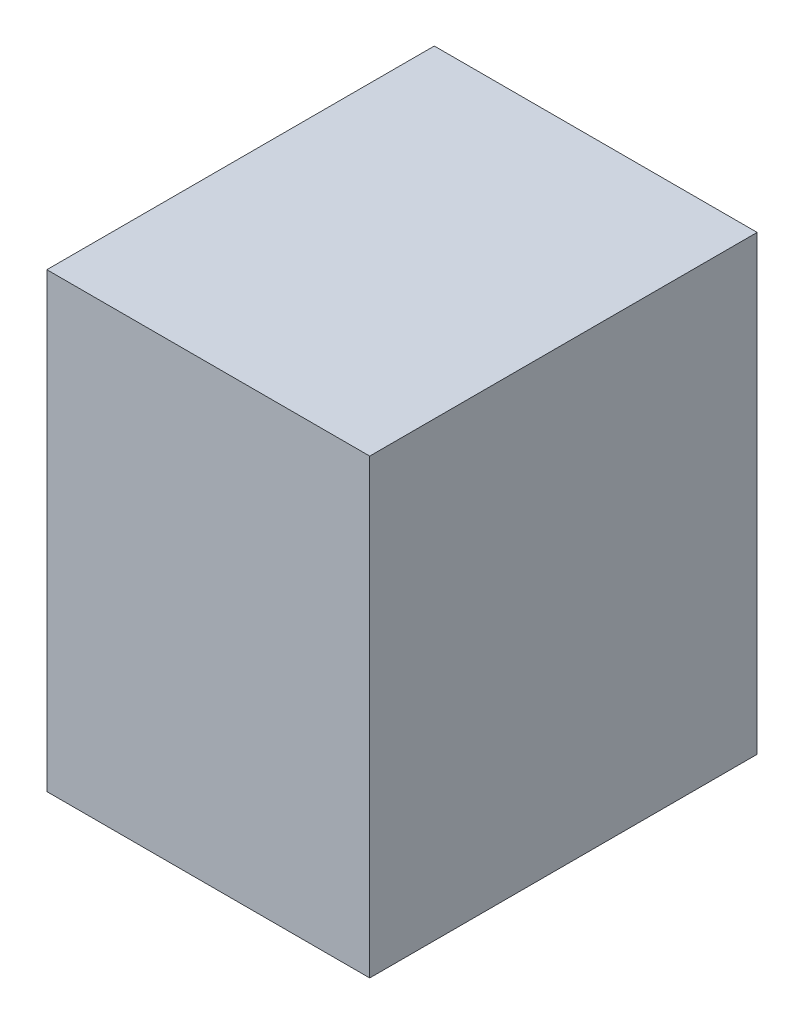
ISO-10303-21;
HEADER;
FILE_DESCRIPTION(('STEP AP214'),'2;1');
FILE_NAME('part.step','',(''),(''),'','','');
FILE_SCHEMA(('AUTOMOTIVE_DESIGN { 1 0 10303 214 1 1 1 1 }'));
ENDSEC;
DATA;
#1=APPLICATION_CONTEXT('core data for automotive mechanical design processes');
#2=APPLICATION_PROTOCOL_DEFINITION('international standard','automotive_design',2000,#1);
#3=PRODUCT_CONTEXT('',#1,'mechanical');
#4=PRODUCT('Part','Part','',(#3));
#5=PRODUCT_RELATED_PRODUCT_CATEGORY('part','',(#4));
#6=PRODUCT_DEFINITION_FORMATION('','',#4);
#7=PRODUCT_DEFINITION_CONTEXT('part definition',#1,'design');
#8=PRODUCT_DEFINITION('design','',#6,#7);
#9=PRODUCT_DEFINITION_SHAPE('','',#8);
#10=(LENGTH_UNIT() NAMED_UNIT(*) SI_UNIT(.MILLI.,.METRE.));
#11=(NAMED_UNIT(*) PLANE_ANGLE_UNIT() SI_UNIT($,.RADIAN.));
#12=(NAMED_UNIT(*) SI_UNIT($,.STERADIAN.) SOLID_ANGLE_UNIT());
#13=UNCERTAINTY_MEASURE_WITH_UNIT(LENGTH_MEASURE(1.E-05),#10,'distance_accuracy_value','');
#14=(GEOMETRIC_REPRESENTATION_CONTEXT(3) GLOBAL_UNCERTAINTY_ASSIGNED_CONTEXT((#13)) GLOBAL_UNIT_ASSIGNED_CONTEXT((#10,
#11,#12)) REPRESENTATION_CONTEXT('',''));
#15=CARTESIAN_POINT('',(0.,0.,0.));
#16=DIRECTION('',(0.,0.,1.));
#17=DIRECTION('',(1.,0.,0.));
#18=AXIS2_PLACEMENT_3D('',#15,#16,#17);
#19=CARTESIAN_POINT('',(-65.3514271572348,35.9943181818182,60.));
#20=DIRECTION('',(1.,0.,0.));
#21=DIRECTION('',(0.,0.,-1.));
#22=AXIS2_PLACEMENT_3D('',#19,#20,#21);
#23=PLANE('',#22);
#24=DIRECTION('',(0.,-1.,0.));
#25=VECTOR('',#24,1.);
#26=CARTESIAN_POINT('',(-65.3514271572348,35.9943181818182,0.));
#27=LINE('',#26,#25);
#28=CARTESIAN_POINT('',(-65.3514271572348,35.9943181818182,0.));
#29=VERTEX_POINT('',#28);
#30=CARTESIAN_POINT('',(-65.3514271572348,-34.0056818181818,0.));
#31=VERTEX_POINT('',#30);
#32=EDGE_CURVE('E96',#29,#31,#27,.T.);
#33=ORIENTED_EDGE('',*,*,#32,.T.);
#34=DIRECTION('',(0.,0.,-1.));
#35=VECTOR('',#34,1.);
#36=CARTESIAN_POINT('',(-65.3514271572348,-34.0056818181818,60.));
#37=LINE('',#36,#35);
#38=CARTESIAN_POINT('',(-65.3514271572348,-34.0056818181818,60.));
#39=VERTEX_POINT('',#38);
#40=EDGE_CURVE('E11',#39,#31,#37,.T.);
#41=ORIENTED_EDGE('',*,*,#40,.F.);
#42=DIRECTION('',(0.,-1.,0.));
#43=VECTOR('',#42,1.);
#44=CARTESIAN_POINT('',(-65.3514271572348,35.9943181818182,60.));
#45=LINE('',#44,#43);
#46=CARTESIAN_POINT('',(-65.3514271572348,35.9943181818182,60.));
#47=VERTEX_POINT('',#46);
#48=EDGE_CURVE('E84',#47,#39,#45,.T.);
#49=ORIENTED_EDGE('',*,*,#48,.F.);
#50=DIRECTION('',(0.,0.,-1.));
#51=VECTOR('',#50,1.);
#52=CARTESIAN_POINT('',(-65.3514271572348,35.9943181818182,60.));
#53=LINE('',#52,#51);
#54=EDGE_CURVE('E92',#47,#29,#53,.T.);
#55=ORIENTED_EDGE('',*,*,#54,.T.);
#56=EDGE_LOOP('',(#33,#41,#49,#55));
#57=FACE_BOUND('',#56,.T.);
#58=ADVANCED_FACE('F33',(#57),#23,.F.);
#59=CARTESIAN_POINT('',(-65.3514271572348,-34.0056818181818,60.));
#60=DIRECTION('',(0.,1.,0.));
#61=DIRECTION('',(0.,0.,1.));
#62=AXIS2_PLACEMENT_3D('',#59,#60,#61);
#63=PLANE('',#62);
#64=DIRECTION('',(1.,0.,0.));
#65=VECTOR('',#64,1.);
#66=CARTESIAN_POINT('',(-65.3514271572348,-34.0056818181818,0.));
#67=LINE('',#66,#65);
#68=CARTESIAN_POINT('',(-15.3514271572347,-34.0056818181818,0.));
#69=VERTEX_POINT('',#68);
#70=EDGE_CURVE('E88',#31,#69,#67,.T.);
#71=ORIENTED_EDGE('',*,*,#70,.T.);
#72=DIRECTION('',(0.,0.,-1.));
#73=VECTOR('',#72,1.);
#74=CARTESIAN_POINT('',(-15.3514271572347,-34.0056818181818,60.));
#75=LINE('',#74,#73);
#76=CARTESIAN_POINT('',(-15.3514271572347,-34.0056818181818,60.));
#77=VERTEX_POINT('',#76);
#78=EDGE_CURVE('E41',#77,#69,#75,.T.);
#79=ORIENTED_EDGE('',*,*,#78,.F.);
#80=DIRECTION('',(1.,0.,0.));
#81=VECTOR('',#80,1.);
#82=CARTESIAN_POINT('',(-65.3514271572348,-34.0056818181818,60.));
#83=LINE('',#82,#81);
#84=EDGE_CURVE('E79',#39,#77,#83,.T.);
#85=ORIENTED_EDGE('',*,*,#84,.F.);
#86=ORIENTED_EDGE('',*,*,#40,.T.);
#87=EDGE_LOOP('',(#71,#79,#85,#86));
#88=FACE_BOUND('',#87,.T.);
#89=ADVANCED_FACE('F87',(#88),#63,.F.);
#90=CARTESIAN_POINT('',(-15.3514271572348,35.9943181818182,60.));
#91=DIRECTION('',(-1.,0.,0.));
#92=DIRECTION('',(0.,-1.,0.));
#93=AXIS2_PLACEMENT_3D('',#90,#91,#92);
#94=PLANE('',#93);
#95=DIRECTION('',(0.,1.,0.));
#96=VECTOR('',#95,1.);
#97=CARTESIAN_POINT('',(-15.3514271572348,35.9943181818182,0.));
#98=LINE('',#97,#96);
#99=CARTESIAN_POINT('',(-15.3514271572348,35.9943181818182,0.));
#100=VERTEX_POINT('',#99);
#101=EDGE_CURVE('E66',#69,#100,#98,.T.);
#102=ORIENTED_EDGE('',*,*,#101,.T.);
#103=DIRECTION('',(0.,0.,-1.));
#104=VECTOR('',#103,1.);
#105=CARTESIAN_POINT('',(-15.3514271572348,35.9943181818182,60.));
#106=LINE('',#105,#104);
#107=CARTESIAN_POINT('',(-15.3514271572348,35.9943181818182,60.));
#108=VERTEX_POINT('',#107);
#109=EDGE_CURVE('E89',#108,#100,#106,.T.);
#110=ORIENTED_EDGE('',*,*,#109,.F.);
#111=DIRECTION('',(0.,1.,0.));
#112=VECTOR('',#111,1.);
#113=CARTESIAN_POINT('',(-15.3514271572348,35.9943181818182,60.));
#114=LINE('',#113,#112);
#115=EDGE_CURVE('E82',#77,#108,#114,.T.);
#116=ORIENTED_EDGE('',*,*,#115,.F.);
#117=ORIENTED_EDGE('',*,*,#78,.T.);
#118=EDGE_LOOP('',(#102,#110,#116,#117));
#119=FACE_BOUND('',#118,.T.);
#120=ADVANCED_FACE('F90',(#119),#94,.F.);
#121=CARTESIAN_POINT('',(-65.3514271572348,35.9943181818182,60.));
#122=DIRECTION('',(0.,-1.,0.));
#123=DIRECTION('',(0.,0.,-1.));
#124=AXIS2_PLACEMENT_3D('',#121,#122,#123);
#125=PLANE('',#124);
#126=DIRECTION('',(-1.,0.,0.));
#127=VECTOR('',#126,1.);
#128=CARTESIAN_POINT('',(-65.3514271572348,35.9943181818182,0.));
#129=LINE('',#128,#127);
#130=EDGE_CURVE('E72',#100,#29,#129,.T.);
#131=ORIENTED_EDGE('',*,*,#130,.T.);
#132=ORIENTED_EDGE('',*,*,#54,.F.);
#133=DIRECTION('',(-1.,0.,0.));
#134=VECTOR('',#133,1.);
#135=CARTESIAN_POINT('',(-65.3514271572348,35.9943181818182,60.));
#136=LINE('',#135,#134);
#137=EDGE_CURVE('E49',#108,#47,#136,.T.);
#138=ORIENTED_EDGE('',*,*,#137,.F.);
#139=ORIENTED_EDGE('',*,*,#109,.T.);
#140=EDGE_LOOP('',(#131,#132,#138,#139));
#141=FACE_BOUND('',#140,.T.);
#142=ADVANCED_FACE('F103',(#141),#125,.F.);
#143=CARTESIAN_POINT('',(0.,0.,60.));
#144=DIRECTION('',(0.,0.,1.));
#145=DIRECTION('',(1.,0.,0.));
#146=AXIS2_PLACEMENT_3D('',#143,#144,#145);
#147=PLANE('',#146);
#148=ORIENTED_EDGE('',*,*,#48,.T.);
#149=ORIENTED_EDGE('',*,*,#84,.T.);
#150=ORIENTED_EDGE('',*,*,#115,.T.);
#151=ORIENTED_EDGE('',*,*,#137,.T.);
#152=EDGE_LOOP('',(#148,#149,#150,#151));
#153=FACE_BOUND('',#152,.T.);
#154=ADVANCED_FACE('F80',(#153),#147,.T.);
#155=CARTESIAN_POINT('',(0.,0.,0.));
#156=DIRECTION('',(0.,0.,1.));
#157=DIRECTION('',(1.,0.,0.));
#158=AXIS2_PLACEMENT_3D('',#155,#156,#157);
#159=PLANE('',#158);
#160=ORIENTED_EDGE('',*,*,#32,.F.);
#161=ORIENTED_EDGE('',*,*,#130,.F.);
#162=ORIENTED_EDGE('',*,*,#101,.F.);
#163=ORIENTED_EDGE('',*,*,#70,.F.);
#164=EDGE_LOOP('',(#160,#161,#162,#163));
#165=FACE_BOUND('',#164,.T.);
#166=ADVANCED_FACE('F106',(#165),#159,.F.);
#167=CLOSED_SHELL('',(#58,#89,#120,#142,#154,#166));
#168=MANIFOLD_SOLID_BREP('B2',#167);
#169=ADVANCED_BREP_SHAPE_REPRESENTATION('',(#18,#168),#14);
#170=SHAPE_DEFINITION_REPRESENTATION(#9,#169);
ENDSEC;
END-ISO-10303-21;
